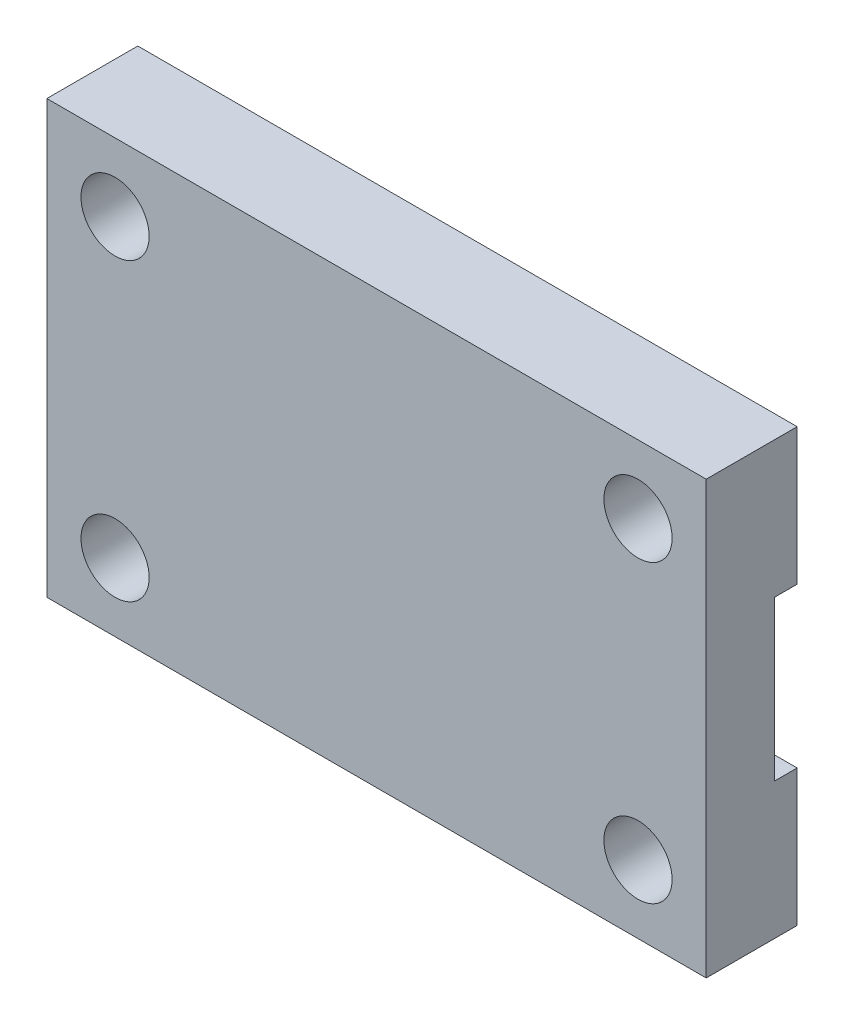
ISO-10303-21;
HEADER;
FILE_DESCRIPTION(('STEP AP214'),'2;1');
FILE_NAME('part.step','',(''),(''),'','','');
FILE_SCHEMA(('AUTOMOTIVE_DESIGN { 1 0 10303 214 1 1 1 1 }'));
ENDSEC;
DATA;
#1=APPLICATION_CONTEXT('core data for automotive mechanical design processes');
#2=APPLICATION_PROTOCOL_DEFINITION('international standard','automotive_design',2000,#1);
#3=PRODUCT_CONTEXT('',#1,'mechanical');
#4=PRODUCT('Part','Part','',(#3));
#5=PRODUCT_RELATED_PRODUCT_CATEGORY('part','',(#4));
#6=PRODUCT_DEFINITION_FORMATION('','',#4);
#7=PRODUCT_DEFINITION_CONTEXT('part definition',#1,'design');
#8=PRODUCT_DEFINITION('design','',#6,#7);
#9=PRODUCT_DEFINITION_SHAPE('','',#8);
#10=(LENGTH_UNIT() NAMED_UNIT(*) SI_UNIT(.MILLI.,.METRE.));
#11=(NAMED_UNIT(*) PLANE_ANGLE_UNIT() SI_UNIT($,.RADIAN.));
#12=(NAMED_UNIT(*) SI_UNIT($,.STERADIAN.) SOLID_ANGLE_UNIT());
#13=UNCERTAINTY_MEASURE_WITH_UNIT(LENGTH_MEASURE(1.E-05),#10,'distance_accuracy_value','');
#14=(GEOMETRIC_REPRESENTATION_CONTEXT(3) GLOBAL_UNCERTAINTY_ASSIGNED_CONTEXT((#13)) GLOBAL_UNIT_ASSIGNED_CONTEXT((#10,
#11,#12)) REPRESENTATION_CONTEXT('',''));
#15=CARTESIAN_POINT('',(0.,0.,0.));
#16=DIRECTION('',(0.,0.,1.));
#17=DIRECTION('',(1.,0.,0.));
#18=AXIS2_PLACEMENT_3D('',#15,#16,#17);
#19=CARTESIAN_POINT('',(0.,0.,0.));
#20=DIRECTION('',(0.,0.,1.));
#21=DIRECTION('',(1.,0.,0.));
#22=AXIS2_PLACEMENT_3D('',#19,#20,#21);
#23=PLANE('',#22);
#24=CARTESIAN_POINT('',(26.,16.,0.));
#25=DIRECTION('',(0.,0.,1.));
#26=DIRECTION('',(1.,0.,0.));
#27=AXIS2_PLACEMENT_3D('',#24,#25,#26);
#28=CIRCLE('',#27,1.5);
#29=CARTESIAN_POINT('',(27.5,16.,0.));
#30=VERTEX_POINT('',#29);
#31=EDGE_CURVE('E139',#30,#30,#28,.T.);
#32=ORIENTED_EDGE('',*,*,#31,.T.);
#33=EDGE_LOOP('',(#32));
#34=FACE_BOUND('',#33,.T.);
#35=CARTESIAN_POINT('',(3.,16.,0.));
#36=DIRECTION('',(0.,0.,1.));
#37=DIRECTION('',(1.,0.,0.));
#38=AXIS2_PLACEMENT_3D('',#35,#36,#37);
#39=CIRCLE('',#38,1.5);
#40=CARTESIAN_POINT('',(4.5,16.,0.));
#41=VERTEX_POINT('',#40);
#42=EDGE_CURVE('E151',#41,#41,#39,.T.);
#43=ORIENTED_EDGE('',*,*,#42,.T.);
#44=EDGE_LOOP('',(#43));
#45=FACE_BOUND('',#44,.T.);
#46=DIRECTION('',(0.,1.,0.));
#47=VECTOR('',#46,1.);
#48=CARTESIAN_POINT('',(29.,0.,0.));
#49=LINE('',#48,#47);
#50=CARTESIAN_POINT('',(29.,13.,0.));
#51=VERTEX_POINT('',#50);
#52=CARTESIAN_POINT('',(29.,19.,0.));
#53=VERTEX_POINT('',#52);
#54=EDGE_CURVE('E172',#51,#53,#49,.T.);
#55=ORIENTED_EDGE('',*,*,#54,.F.);
#56=DIRECTION('',(1.,0.,0.));
#57=VECTOR('',#56,1.);
#58=CARTESIAN_POINT('',(0.,13.,0.));
#59=LINE('',#58,#57);
#60=CARTESIAN_POINT('',(0.,13.,0.));
#61=VERTEX_POINT('',#60);
#62=EDGE_CURVE('E185',#61,#51,#59,.T.);
#63=ORIENTED_EDGE('',*,*,#62,.F.);
#64=DIRECTION('',(0.,-1.,0.));
#65=VECTOR('',#64,1.);
#66=CARTESIAN_POINT('',(0.,19.,0.));
#67=LINE('',#66,#65);
#68=CARTESIAN_POINT('',(0.,19.,0.));
#69=VERTEX_POINT('',#68);
#70=EDGE_CURVE('E167',#69,#61,#67,.T.);
#71=ORIENTED_EDGE('',*,*,#70,.F.);
#72=DIRECTION('',(-1.,0.,0.));
#73=VECTOR('',#72,1.);
#74=CARTESIAN_POINT('',(29.,19.,0.));
#75=LINE('',#74,#73);
#76=EDGE_CURVE('E78',#53,#69,#75,.T.);
#77=ORIENTED_EDGE('',*,*,#76,.F.);
#78=EDGE_LOOP('',(#55,#63,#71,#77));
#79=FACE_BOUND('',#78,.T.);
#80=ADVANCED_FACE('F33',(#34,#45,#79),#23,.F.);
#81=CARTESIAN_POINT('',(0.,0.,4.));
#82=DIRECTION('',(0.,0.,1.));
#83=DIRECTION('',(1.,0.,0.));
#84=AXIS2_PLACEMENT_3D('',#81,#82,#83);
#85=PLANE('',#84);
#86=CARTESIAN_POINT('',(26.,3.,4.));
#87=DIRECTION('',(0.,0.,1.));
#88=DIRECTION('',(1.,0.,0.));
#89=AXIS2_PLACEMENT_3D('',#86,#87,#88);
#90=CIRCLE('',#89,1.5);
#91=CARTESIAN_POINT('',(27.5,3.,4.));
#92=VERTEX_POINT('',#91);
#93=EDGE_CURVE('E142',#92,#92,#90,.T.);
#94=ORIENTED_EDGE('',*,*,#93,.F.);
#95=EDGE_LOOP('',(#94));
#96=FACE_BOUND('',#95,.T.);
#97=CARTESIAN_POINT('',(3.,16.,4.));
#98=DIRECTION('',(0.,0.,1.));
#99=DIRECTION('',(1.,0.,0.));
#100=AXIS2_PLACEMENT_3D('',#97,#98,#99);
#101=CIRCLE('',#100,1.5);
#102=CARTESIAN_POINT('',(4.5,16.,4.));
#103=VERTEX_POINT('',#102);
#104=EDGE_CURVE('E154',#103,#103,#101,.T.);
#105=ORIENTED_EDGE('',*,*,#104,.F.);
#106=EDGE_LOOP('',(#105));
#107=FACE_BOUND('',#106,.T.);
#108=DIRECTION('',(0.,-1.,0.));
#109=VECTOR('',#108,1.);
#110=CARTESIAN_POINT('',(0.,19.,4.));
#111=LINE('',#110,#109);
#112=CARTESIAN_POINT('',(0.,19.,4.));
#113=VERTEX_POINT('',#112);
#114=CARTESIAN_POINT('',(0.,0.,4.));
#115=VERTEX_POINT('',#114);
#116=EDGE_CURVE('E160',#113,#115,#111,.T.);
#117=ORIENTED_EDGE('',*,*,#116,.T.);
#118=DIRECTION('',(1.,0.,0.));
#119=VECTOR('',#118,1.);
#120=CARTESIAN_POINT('',(0.,0.,4.));
#121=LINE('',#120,#119);
#122=CARTESIAN_POINT('',(29.,0.,4.));
#123=VERTEX_POINT('',#122);
#124=EDGE_CURVE('E85',#115,#123,#121,.T.);
#125=ORIENTED_EDGE('',*,*,#124,.T.);
#126=DIRECTION('',(0.,1.,0.));
#127=VECTOR('',#126,1.);
#128=CARTESIAN_POINT('',(29.,0.,4.));
#129=LINE('',#128,#127);
#130=CARTESIAN_POINT('',(29.,19.,4.));
#131=VERTEX_POINT('',#130);
#132=EDGE_CURVE('E163',#123,#131,#129,.T.);
#133=ORIENTED_EDGE('',*,*,#132,.T.);
#134=DIRECTION('',(-1.,0.,0.));
#135=VECTOR('',#134,1.);
#136=CARTESIAN_POINT('',(29.,19.,4.));
#137=LINE('',#136,#135);
#138=EDGE_CURVE('E57',#131,#113,#137,.T.);
#139=ORIENTED_EDGE('',*,*,#138,.T.);
#140=EDGE_LOOP('',(#117,#125,#133,#139));
#141=FACE_BOUND('',#140,.T.);
#142=CARTESIAN_POINT('',(3.,3.,4.));
#143=DIRECTION('',(0.,0.,1.));
#144=DIRECTION('',(1.,0.,0.));
#145=AXIS2_PLACEMENT_3D('',#142,#143,#144);
#146=CIRCLE('',#145,1.5);
#147=CARTESIAN_POINT('',(4.5,3.,4.));
#148=VERTEX_POINT('',#147);
#149=EDGE_CURVE('E148',#148,#148,#146,.T.);
#150=ORIENTED_EDGE('',*,*,#149,.F.);
#151=EDGE_LOOP('',(#150));
#152=FACE_BOUND('',#151,.T.);
#153=CARTESIAN_POINT('',(26.,16.,4.));
#154=DIRECTION('',(0.,0.,1.));
#155=DIRECTION('',(1.,0.,0.));
#156=AXIS2_PLACEMENT_3D('',#153,#154,#155);
#157=CIRCLE('',#156,1.5);
#158=CARTESIAN_POINT('',(27.5,16.,4.));
#159=VERTEX_POINT('',#158);
#160=EDGE_CURVE('E135',#159,#159,#157,.T.);
#161=ORIENTED_EDGE('',*,*,#160,.F.);
#162=EDGE_LOOP('',(#161));
#163=FACE_BOUND('',#162,.T.);
#164=ADVANCED_FACE('F215',(#96,#107,#141,#152,#163),#85,.T.);
#165=CARTESIAN_POINT('',(0.,6.,0.));
#166=VERTEX_POINT('',#165);
#167=CARTESIAN_POINT('',(0.,0.,0.));
#168=VERTEX_POINT('',#167);
#169=EDGE_CURVE('E157',#166,#168,#67,.T.);
#170=ORIENTED_EDGE('',*,*,#169,.F.);
#171=DIRECTION('',(-1.,0.,0.));
#172=VECTOR('',#171,1.);
#173=CARTESIAN_POINT('',(29.,6.,0.));
#174=LINE('',#173,#172);
#175=CARTESIAN_POINT('',(29.,6.,0.));
#176=VERTEX_POINT('',#175);
#177=EDGE_CURVE('E184',#176,#166,#174,.T.);
#178=ORIENTED_EDGE('',*,*,#177,.F.);
#179=CARTESIAN_POINT('',(29.,0.,0.));
#180=VERTEX_POINT('',#179);
#181=EDGE_CURVE('E127',#180,#176,#49,.T.);
#182=ORIENTED_EDGE('',*,*,#181,.F.);
#183=DIRECTION('',(1.,0.,0.));
#184=VECTOR('',#183,1.);
#185=CARTESIAN_POINT('',(0.,0.,0.));
#186=LINE('',#185,#184);
#187=EDGE_CURVE('E170',#168,#180,#186,.T.);
#188=ORIENTED_EDGE('',*,*,#187,.F.);
#189=EDGE_LOOP('',(#170,#178,#182,#188));
#190=FACE_BOUND('',#189,.T.);
#191=CARTESIAN_POINT('',(3.,3.,0.));
#192=DIRECTION('',(0.,0.,1.));
#193=DIRECTION('',(1.,0.,0.));
#194=AXIS2_PLACEMENT_3D('',#191,#192,#193);
#195=CIRCLE('',#194,1.5);
#196=CARTESIAN_POINT('',(4.5,3.,0.));
#197=VERTEX_POINT('',#196);
#198=EDGE_CURVE('E145',#197,#197,#195,.T.);
#199=ORIENTED_EDGE('',*,*,#198,.T.);
#200=EDGE_LOOP('',(#199));
#201=FACE_BOUND('',#200,.T.);
#202=CARTESIAN_POINT('',(26.,3.,0.));
#203=DIRECTION('',(0.,0.,1.));
#204=DIRECTION('',(1.,0.,0.));
#205=AXIS2_PLACEMENT_3D('',#202,#203,#204);
#206=CIRCLE('',#205,1.5);
#207=CARTESIAN_POINT('',(27.5,3.,0.));
#208=VERTEX_POINT('',#207);
#209=EDGE_CURVE('E138',#208,#208,#206,.T.);
#210=ORIENTED_EDGE('',*,*,#209,.T.);
#211=EDGE_LOOP('',(#210));
#212=FACE_BOUND('',#211,.T.);
#213=ADVANCED_FACE('F182',(#190,#201,#212),#23,.F.);
#214=CARTESIAN_POINT('',(0.,19.,4.));
#215=DIRECTION('',(1.,0.,0.));
#216=DIRECTION('',(0.,1.,0.));
#217=AXIS2_PLACEMENT_3D('',#214,#215,#216);
#218=PLANE('',#217);
#219=ORIENTED_EDGE('',*,*,#70,.T.);
#220=DIRECTION('',(0.,0.,-1.));
#221=VECTOR('',#220,1.);
#222=CARTESIAN_POINT('',(0.,13.,1.));
#223=LINE('',#222,#221);
#224=CARTESIAN_POINT('',(0.,13.,1.));
#225=VERTEX_POINT('',#224);
#226=EDGE_CURVE('E130',#225,#61,#223,.T.);
#227=ORIENTED_EDGE('',*,*,#226,.F.);
#228=DIRECTION('',(0.,1.,0.));
#229=VECTOR('',#228,1.);
#230=CARTESIAN_POINT('',(0.,6.,1.));
#231=LINE('',#230,#229);
#232=CARTESIAN_POINT('',(0.,6.,1.));
#233=VERTEX_POINT('',#232);
#234=EDGE_CURVE('E115',#233,#225,#231,.T.);
#235=ORIENTED_EDGE('',*,*,#234,.F.);
#236=DIRECTION('',(0.,0.,-1.));
#237=VECTOR('',#236,1.);
#238=CARTESIAN_POINT('',(0.,6.,1.));
#239=LINE('',#238,#237);
#240=EDGE_CURVE('E113',#233,#166,#239,.T.);
#241=ORIENTED_EDGE('',*,*,#240,.T.);
#242=ORIENTED_EDGE('',*,*,#169,.T.);
#243=DIRECTION('',(0.,0.,-1.));
#244=VECTOR('',#243,1.);
#245=CARTESIAN_POINT('',(0.,0.,4.));
#246=LINE('',#245,#244);
#247=EDGE_CURVE('E11',#115,#168,#246,.T.);
#248=ORIENTED_EDGE('',*,*,#247,.F.);
#249=ORIENTED_EDGE('',*,*,#116,.F.);
#250=DIRECTION('',(0.,0.,-1.));
#251=VECTOR('',#250,1.);
#252=CARTESIAN_POINT('',(0.,19.,4.));
#253=LINE('',#252,#251);
#254=EDGE_CURVE('E166',#113,#69,#253,.T.);
#255=ORIENTED_EDGE('',*,*,#254,.T.);
#256=EDGE_LOOP('',(#219,#227,#235,#241,#242,#248,#249,#255));
#257=FACE_BOUND('',#256,.T.);
#258=ADVANCED_FACE('F35',(#257),#218,.F.);
#259=CARTESIAN_POINT('',(0.,0.,4.));
#260=DIRECTION('',(0.,1.,0.));
#261=DIRECTION('',(0.,0.,1.));
#262=AXIS2_PLACEMENT_3D('',#259,#260,#261);
#263=PLANE('',#262);
#264=ORIENTED_EDGE('',*,*,#187,.T.);
#265=DIRECTION('',(0.,0.,-1.));
#266=VECTOR('',#265,1.);
#267=CARTESIAN_POINT('',(29.,0.,4.));
#268=LINE('',#267,#266);
#269=EDGE_CURVE('E41',#123,#180,#268,.T.);
#270=ORIENTED_EDGE('',*,*,#269,.F.);
#271=ORIENTED_EDGE('',*,*,#124,.F.);
#272=ORIENTED_EDGE('',*,*,#247,.T.);
#273=EDGE_LOOP('',(#264,#270,#271,#272));
#274=FACE_BOUND('',#273,.T.);
#275=ADVANCED_FACE('F211',(#274),#263,.F.);
#276=CARTESIAN_POINT('',(29.,0.,4.));
#277=DIRECTION('',(-1.,0.,0.));
#278=DIRECTION('',(0.,0.,1.));
#279=AXIS2_PLACEMENT_3D('',#276,#277,#278);
#280=PLANE('',#279);
#281=DIRECTION('',(0.,-1.,0.));
#282=VECTOR('',#281,1.);
#283=CARTESIAN_POINT('',(29.,13.,1.));
#284=LINE('',#283,#282);
#285=CARTESIAN_POINT('',(29.,13.,1.));
#286=VERTEX_POINT('',#285);
#287=CARTESIAN_POINT('',(29.,6.,1.));
#288=VERTEX_POINT('',#287);
#289=EDGE_CURVE('E116',#286,#288,#284,.T.);
#290=ORIENTED_EDGE('',*,*,#289,.F.);
#291=DIRECTION('',(0.,0.,-1.));
#292=VECTOR('',#291,1.);
#293=CARTESIAN_POINT('',(29.,13.,1.));
#294=LINE('',#293,#292);
#295=EDGE_CURVE('E128',#286,#51,#294,.T.);
#296=ORIENTED_EDGE('',*,*,#295,.T.);
#297=ORIENTED_EDGE('',*,*,#54,.T.);
#298=DIRECTION('',(0.,0.,-1.));
#299=VECTOR('',#298,1.);
#300=CARTESIAN_POINT('',(29.,19.,4.));
#301=LINE('',#300,#299);
#302=EDGE_CURVE('E176',#131,#53,#301,.T.);
#303=ORIENTED_EDGE('',*,*,#302,.F.);
#304=ORIENTED_EDGE('',*,*,#132,.F.);
#305=ORIENTED_EDGE('',*,*,#269,.T.);
#306=ORIENTED_EDGE('',*,*,#181,.T.);
#307=DIRECTION('',(0.,0.,-1.));
#308=VECTOR('',#307,1.);
#309=CARTESIAN_POINT('',(29.,6.,1.));
#310=LINE('',#309,#308);
#311=EDGE_CURVE('E110',#288,#176,#310,.T.);
#312=ORIENTED_EDGE('',*,*,#311,.F.);
#313=EDGE_LOOP('',(#290,#296,#297,#303,#304,#305,#306,#312));
#314=FACE_BOUND('',#313,.T.);
#315=ADVANCED_FACE('F124',(#314),#280,.F.);
#316=CARTESIAN_POINT('',(29.,19.,4.));
#317=DIRECTION('',(0.,-1.,0.));
#318=DIRECTION('',(0.,0.,-1.));
#319=AXIS2_PLACEMENT_3D('',#316,#317,#318);
#320=PLANE('',#319);
#321=ORIENTED_EDGE('',*,*,#76,.T.);
#322=ORIENTED_EDGE('',*,*,#254,.F.);
#323=ORIENTED_EDGE('',*,*,#138,.F.);
#324=ORIENTED_EDGE('',*,*,#302,.T.);
#325=EDGE_LOOP('',(#321,#322,#323,#324));
#326=FACE_BOUND('',#325,.T.);
#327=ADVANCED_FACE('F200',(#326),#320,.F.);
#328=CARTESIAN_POINT('',(3.,16.,4.));
#329=DIRECTION('',(0.,0.,-1.));
#330=DIRECTION('',(-1.,0.,0.));
#331=AXIS2_PLACEMENT_3D('',#328,#329,#330);
#332=CYLINDRICAL_SURFACE('',#331,1.5);
#333=ORIENTED_EDGE('',*,*,#104,.T.);
#334=EDGE_LOOP('',(#333));
#335=FACE_BOUND('',#334,.T.);
#336=ORIENTED_EDGE('',*,*,#42,.F.);
#337=EDGE_LOOP('',(#336));
#338=FACE_BOUND('',#337,.T.);
#339=ADVANCED_FACE('F202',(#335,#338),#332,.F.);
#340=CARTESIAN_POINT('',(3.,3.,4.));
#341=DIRECTION('',(0.,0.,-1.));
#342=DIRECTION('',(-1.,0.,0.));
#343=AXIS2_PLACEMENT_3D('',#340,#341,#342);
#344=CYLINDRICAL_SURFACE('',#343,1.5);
#345=ORIENTED_EDGE('',*,*,#149,.T.);
#346=EDGE_LOOP('',(#345));
#347=FACE_BOUND('',#346,.T.);
#348=ORIENTED_EDGE('',*,*,#198,.F.);
#349=EDGE_LOOP('',(#348));
#350=FACE_BOUND('',#349,.T.);
#351=ADVANCED_FACE('F208',(#347,#350),#344,.F.);
#352=CARTESIAN_POINT('',(26.,3.,4.));
#353=DIRECTION('',(0.,0.,-1.));
#354=DIRECTION('',(-1.,0.,0.));
#355=AXIS2_PLACEMENT_3D('',#352,#353,#354);
#356=CYLINDRICAL_SURFACE('',#355,1.5);
#357=ORIENTED_EDGE('',*,*,#93,.T.);
#358=EDGE_LOOP('',(#357));
#359=FACE_BOUND('',#358,.T.);
#360=ORIENTED_EDGE('',*,*,#209,.F.);
#361=EDGE_LOOP('',(#360));
#362=FACE_BOUND('',#361,.T.);
#363=ADVANCED_FACE('F273',(#359,#362),#356,.F.);
#364=CARTESIAN_POINT('',(26.,16.,4.));
#365=DIRECTION('',(0.,0.,-1.));
#366=DIRECTION('',(-1.,0.,0.));
#367=AXIS2_PLACEMENT_3D('',#364,#365,#366);
#368=CYLINDRICAL_SURFACE('',#367,1.5);
#369=ORIENTED_EDGE('',*,*,#160,.T.);
#370=EDGE_LOOP('',(#369));
#371=FACE_BOUND('',#370,.T.);
#372=ORIENTED_EDGE('',*,*,#31,.F.);
#373=EDGE_LOOP('',(#372));
#374=FACE_BOUND('',#373,.T.);
#375=ADVANCED_FACE('F249',(#371,#374),#368,.F.);
#376=CARTESIAN_POINT('',(0.,13.,1.));
#377=DIRECTION('',(0.,1.,0.));
#378=DIRECTION('',(-1.,0.,0.));
#379=AXIS2_PLACEMENT_3D('',#376,#377,#378);
#380=PLANE('',#379);
#381=ORIENTED_EDGE('',*,*,#62,.T.);
#382=ORIENTED_EDGE('',*,*,#295,.F.);
#383=DIRECTION('',(1.,0.,0.));
#384=VECTOR('',#383,1.);
#385=CARTESIAN_POINT('',(0.,13.,1.));
#386=LINE('',#385,#384);
#387=EDGE_CURVE('E48',#225,#286,#386,.T.);
#388=ORIENTED_EDGE('',*,*,#387,.F.);
#389=ORIENTED_EDGE('',*,*,#226,.T.);
#390=EDGE_LOOP('',(#381,#382,#388,#389));
#391=FACE_BOUND('',#390,.T.);
#392=ADVANCED_FACE('F193',(#391),#380,.F.);
#393=CARTESIAN_POINT('',(29.,6.,1.));
#394=DIRECTION('',(0.,-1.,0.));
#395=DIRECTION('',(1.,0.,0.));
#396=AXIS2_PLACEMENT_3D('',#393,#394,#395);
#397=PLANE('',#396);
#398=ORIENTED_EDGE('',*,*,#177,.T.);
#399=ORIENTED_EDGE('',*,*,#240,.F.);
#400=DIRECTION('',(-1.,0.,0.));
#401=VECTOR('',#400,1.);
#402=CARTESIAN_POINT('',(29.,6.,1.));
#403=LINE('',#402,#401);
#404=EDGE_CURVE('E107',#288,#233,#403,.T.);
#405=ORIENTED_EDGE('',*,*,#404,.F.);
#406=ORIENTED_EDGE('',*,*,#311,.T.);
#407=EDGE_LOOP('',(#398,#399,#405,#406));
#408=FACE_BOUND('',#407,.T.);
#409=ADVANCED_FACE('F108',(#408),#397,.F.);
#410=CARTESIAN_POINT('',(0.,0.,1.));
#411=DIRECTION('',(0.,0.,-1.));
#412=DIRECTION('',(-1.,0.,0.));
#413=AXIS2_PLACEMENT_3D('',#410,#411,#412);
#414=PLANE('',#413);
#415=ORIENTED_EDGE('',*,*,#387,.T.);
#416=ORIENTED_EDGE('',*,*,#289,.T.);
#417=ORIENTED_EDGE('',*,*,#404,.T.);
#418=ORIENTED_EDGE('',*,*,#234,.T.);
#419=EDGE_LOOP('',(#415,#416,#417,#418));
#420=FACE_BOUND('',#419,.T.);
#421=ADVANCED_FACE('F119',(#420),#414,.T.);
#422=CLOSED_SHELL('',(#80,#164,#213,#258,#275,#315,#327,#339,#351,#363,#375,#392,#409,#421));
#423=MANIFOLD_SOLID_BREP('B2',#422);
#424=ADVANCED_BREP_SHAPE_REPRESENTATION('',(#18,#423),#14);
#425=SHAPE_DEFINITION_REPRESENTATION(#9,#424);
ENDSEC;
END-ISO-10303-21;
